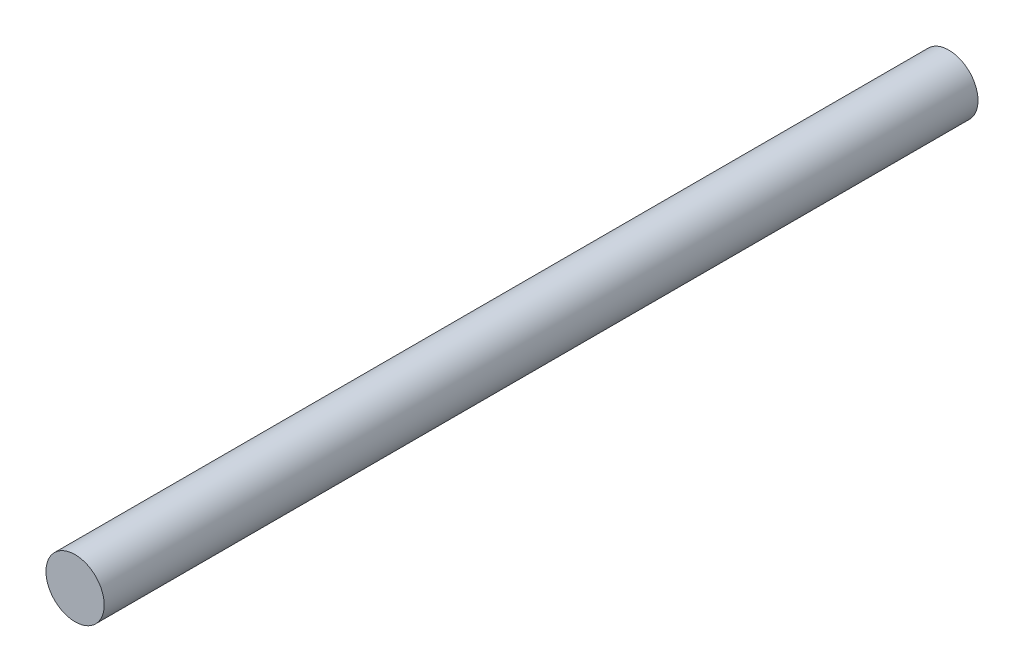
ISO-10303-21;
HEADER;
FILE_DESCRIPTION(('STEP AP214'),'2;1');
FILE_NAME('part.step','',(''),(''),'','','');
FILE_SCHEMA(('AUTOMOTIVE_DESIGN { 1 0 10303 214 1 1 1 1 }'));
ENDSEC;
DATA;
#1=APPLICATION_CONTEXT('core data for automotive mechanical design processes');
#2=APPLICATION_PROTOCOL_DEFINITION('international standard','automotive_design',2000,#1);
#3=PRODUCT_CONTEXT('',#1,'mechanical');
#4=PRODUCT('Part','Part','',(#3));
#5=PRODUCT_RELATED_PRODUCT_CATEGORY('part','',(#4));
#6=PRODUCT_DEFINITION_FORMATION('','',#4);
#7=PRODUCT_DEFINITION_CONTEXT('part definition',#1,'design');
#8=PRODUCT_DEFINITION('design','',#6,#7);
#9=PRODUCT_DEFINITION_SHAPE('','',#8);
#10=(LENGTH_UNIT() NAMED_UNIT(*) SI_UNIT(.MILLI.,.METRE.));
#11=(NAMED_UNIT(*) PLANE_ANGLE_UNIT() SI_UNIT($,.RADIAN.));
#12=(NAMED_UNIT(*) SI_UNIT($,.STERADIAN.) SOLID_ANGLE_UNIT());
#13=UNCERTAINTY_MEASURE_WITH_UNIT(LENGTH_MEASURE(1.E-05),#10,'distance_accuracy_value','');
#14=(GEOMETRIC_REPRESENTATION_CONTEXT(3) GLOBAL_UNCERTAINTY_ASSIGNED_CONTEXT((#13)) GLOBAL_UNIT_ASSIGNED_CONTEXT((#10,
#11,#12)) REPRESENTATION_CONTEXT('',''));
#15=CARTESIAN_POINT('',(0.,0.,0.));
#16=DIRECTION('',(0.,0.,1.));
#17=DIRECTION('',(1.,0.,0.));
#18=AXIS2_PLACEMENT_3D('',#15,#16,#17);
#19=CARTESIAN_POINT('',(-4.25685918714876,1.58684855840003,150.));
#20=DIRECTION('',(0.,0.,-1.));
#21=DIRECTION('',(-1.,0.,0.));
#22=AXIS2_PLACEMENT_3D('',#19,#20,#21);
#23=CYLINDRICAL_SURFACE('',#22,5.);
#24=CARTESIAN_POINT('',(-4.25685918714876,1.58684855840003,150.));
#25=DIRECTION('',(0.,0.,1.));
#26=DIRECTION('',(1.,0.,0.));
#27=AXIS2_PLACEMENT_3D('',#24,#25,#26);
#28=CIRCLE('',#27,5.);
#29=CARTESIAN_POINT('',(0.743140812851238,1.58684855840003,150.));
#30=VERTEX_POINT('',#29);
#31=EDGE_CURVE('E10',#30,#30,#28,.T.);
#32=ORIENTED_EDGE('',*,*,#31,.F.);
#33=EDGE_LOOP('',(#32));
#34=FACE_BOUND('',#33,.T.);
#35=CARTESIAN_POINT('',(-4.25685918714876,1.58684855840003,0.));
#36=DIRECTION('',(0.,0.,1.));
#37=DIRECTION('',(1.,0.,0.));
#38=AXIS2_PLACEMENT_3D('',#35,#36,#37);
#39=CIRCLE('',#38,5.);
#40=CARTESIAN_POINT('',(0.743140812851238,1.58684855840003,0.));
#41=VERTEX_POINT('',#40);
#42=EDGE_CURVE('E34',#41,#41,#39,.T.);
#43=ORIENTED_EDGE('',*,*,#42,.T.);
#44=EDGE_LOOP('',(#43));
#45=FACE_BOUND('',#44,.T.);
#46=ADVANCED_FACE('F31',(#34,#45),#23,.T.);
#47=CARTESIAN_POINT('',(-4.25685918714876,1.58684855840003,150.));
#48=DIRECTION('',(0.,0.,1.));
#49=DIRECTION('',(1.,0.,0.));
#50=AXIS2_PLACEMENT_3D('',#47,#48,#49);
#51=PLANE('',#50);
#52=ORIENTED_EDGE('',*,*,#31,.T.);
#53=EDGE_LOOP('',(#52));
#54=FACE_BOUND('',#53,.T.);
#55=ADVANCED_FACE('F46',(#54),#51,.T.);
#56=CARTESIAN_POINT('',(-4.25685918714876,1.58684855840003,0.));
#57=DIRECTION('',(0.,0.,1.));
#58=DIRECTION('',(1.,0.,0.));
#59=AXIS2_PLACEMENT_3D('',#56,#57,#58);
#60=PLANE('',#59);
#61=ORIENTED_EDGE('',*,*,#42,.F.);
#62=EDGE_LOOP('',(#61));
#63=FACE_BOUND('',#62,.T.);
#64=ADVANCED_FACE('F44',(#63),#60,.F.);
#65=CLOSED_SHELL('',(#46,#55,#64));
#66=MANIFOLD_SOLID_BREP('B2',#65);
#67=ADVANCED_BREP_SHAPE_REPRESENTATION('',(#18,#66),#14);
#68=SHAPE_DEFINITION_REPRESENTATION(#9,#67);
ENDSEC;
END-ISO-10303-21;
